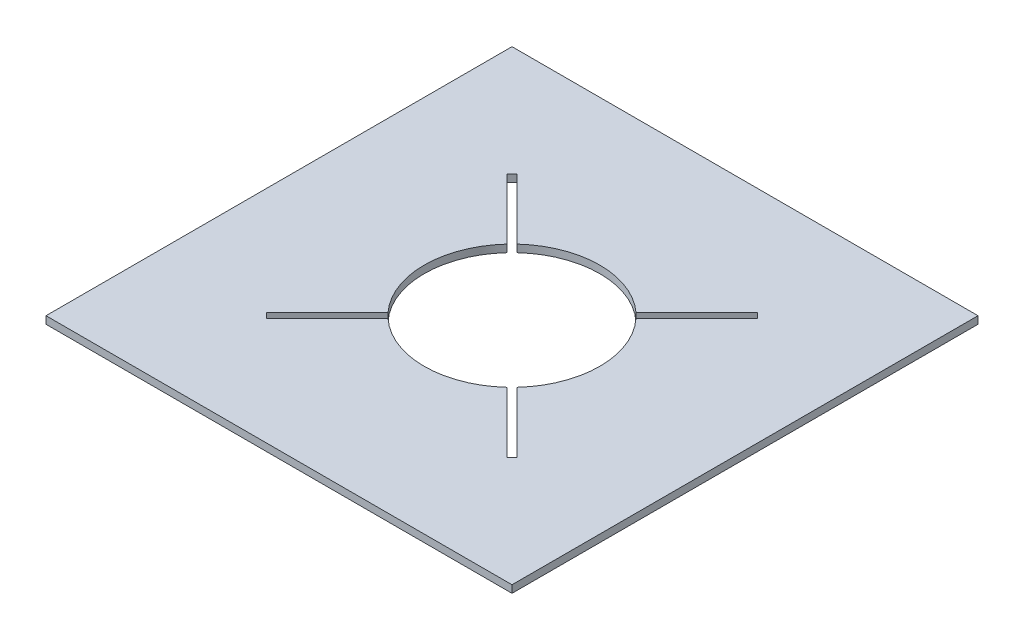
ISO-10303-21;
HEADER;
FILE_DESCRIPTION(('STEP AP214'),'2;1');
FILE_NAME('part.step','',(''),(''),'','','');
FILE_SCHEMA(('AUTOMOTIVE_DESIGN { 1 0 10303 214 1 1 1 1 }'));
ENDSEC;
DATA;
#1=APPLICATION_CONTEXT('core data for automotive mechanical design processes');
#2=APPLICATION_PROTOCOL_DEFINITION('international standard','automotive_design',2000,#1);
#3=PRODUCT_CONTEXT('',#1,'mechanical');
#4=PRODUCT('Part','Part','',(#3));
#5=PRODUCT_RELATED_PRODUCT_CATEGORY('part','',(#4));
#6=PRODUCT_DEFINITION_FORMATION('','',#4);
#7=PRODUCT_DEFINITION_CONTEXT('part definition',#1,'design');
#8=PRODUCT_DEFINITION('design','',#6,#7);
#9=PRODUCT_DEFINITION_SHAPE('','',#8);
#10=(LENGTH_UNIT() NAMED_UNIT(*) SI_UNIT(.MILLI.,.METRE.));
#11=(NAMED_UNIT(*) PLANE_ANGLE_UNIT() SI_UNIT($,.RADIAN.));
#12=(NAMED_UNIT(*) SI_UNIT($,.STERADIAN.) SOLID_ANGLE_UNIT());
#13=UNCERTAINTY_MEASURE_WITH_UNIT(LENGTH_MEASURE(1.E-05),#10,'distance_accuracy_value','');
#14=(GEOMETRIC_REPRESENTATION_CONTEXT(3) GLOBAL_UNCERTAINTY_ASSIGNED_CONTEXT((#13)) GLOBAL_UNIT_ASSIGNED_CONTEXT((#10,
#11,#12)) REPRESENTATION_CONTEXT('',''));
#15=CARTESIAN_POINT('',(0.,0.,0.));
#16=DIRECTION('',(0.,0.,1.));
#17=DIRECTION('',(1.,0.,0.));
#18=AXIS2_PLACEMENT_3D('',#15,#16,#17);
#19=CARTESIAN_POINT('',(0.,0.,0.));
#20=DIRECTION('',(0.,1.,0.));
#21=DIRECTION('',(0.,0.,1.));
#22=AXIS2_PLACEMENT_3D('',#19,#20,#21);
#23=CYLINDRICAL_SURFACE('',#22,77.79258);
#24=CARTESIAN_POINT('',(0.,0.,0.));
#25=DIRECTION('',(0.,1.,0.));
#26=DIRECTION('',(0.,0.,1.));
#27=AXIS2_PLACEMENT_3D('',#24,#25,#26);
#28=CIRCLE('',#27,77.79258);
#29=CARTESIAN_POINT('',(-57.2671491611775,0.,-52.6512975149506));
#30=VERTEX_POINT('',#29);
#31=CARTESIAN_POINT('',(-57.2585452817652,0.,52.6606541477833));
#32=VERTEX_POINT('',#31);
#33=EDGE_CURVE('E259',#30,#32,#28,.T.);
#34=ORIENTED_EDGE('',*,*,#33,.F.);
#35=DIRECTION('',(0.,1.,0.));
#36=VECTOR('',#35,1.);
#37=CARTESIAN_POINT('',(-57.2671491611775,0.,-52.6512975149506));
#38=LINE('',#37,#36);
#39=CARTESIAN_POINT('',(-57.2671491611775,6.60400000000002,-52.6512975149506));
#40=VERTEX_POINT('',#39);
#41=EDGE_CURVE('E217',#30,#40,#38,.T.);
#42=ORIENTED_EDGE('',*,*,#41,.T.);
#43=CARTESIAN_POINT('',(0.,6.60400000000002,0.));
#44=DIRECTION('',(0.,1.,0.));
#45=DIRECTION('',(0.,0.,1.));
#46=AXIS2_PLACEMENT_3D('',#43,#44,#45);
#47=CIRCLE('',#46,77.79258);
#48=CARTESIAN_POINT('',(-57.2585452817652,6.60400000000002,52.6606541477833));
#49=VERTEX_POINT('',#48);
#50=EDGE_CURVE('E265',#40,#49,#47,.T.);
#51=ORIENTED_EDGE('',*,*,#50,.T.);
#52=DIRECTION('',(0.,1.,0.));
#53=VECTOR('',#52,1.);
#54=CARTESIAN_POINT('',(-57.2585452817652,0.,52.6606541477833));
#55=LINE('',#54,#53);
#56=EDGE_CURVE('E306',#49,#32,#55,.F.);
#57=ORIENTED_EDGE('',*,*,#56,.T.);
#58=EDGE_LOOP('',(#34,#42,#51,#57));
#59=FACE_BOUND('',#58,.T.);
#60=ADVANCED_FACE('F33',(#59),#23,.F.);
#61=CARTESIAN_POINT('',(-52.660654147783,6.60400000000002,57.2585452817654));
#62=VERTEX_POINT('',#61);
#63=CARTESIAN_POINT('',(52.6512975149512,6.60400000000002,57.267149161177));
#64=VERTEX_POINT('',#63);
#65=EDGE_CURVE('E262',#62,#64,#47,.T.);
#66=ORIENTED_EDGE('',*,*,#65,.T.);
#67=DIRECTION('',(0.,1.,0.));
#68=VECTOR('',#67,1.);
#69=CARTESIAN_POINT('',(52.6512975149512,0.,57.267149161177));
#70=LINE('',#69,#68);
#71=CARTESIAN_POINT('',(52.6512975149512,0.,57.267149161177));
#72=VERTEX_POINT('',#71);
#73=EDGE_CURVE('E11',#64,#72,#70,.F.);
#74=ORIENTED_EDGE('',*,*,#73,.T.);
#75=CARTESIAN_POINT('',(-52.660654147783,0.,57.2585452817654));
#76=VERTEX_POINT('',#75);
#77=EDGE_CURVE('E257',#76,#72,#28,.T.);
#78=ORIENTED_EDGE('',*,*,#77,.F.);
#79=DIRECTION('',(0.,1.,0.));
#80=VECTOR('',#79,1.);
#81=CARTESIAN_POINT('',(-52.6606541477831,0.,57.2585452817654));
#82=LINE('',#81,#80);
#83=EDGE_CURVE('E291',#76,#62,#82,.T.);
#84=ORIENTED_EDGE('',*,*,#83,.T.);
#85=EDGE_LOOP('',(#66,#74,#78,#84));
#86=FACE_BOUND('',#85,.T.);
#87=ADVANCED_FACE('F371',(#86),#23,.F.);
#88=CARTESIAN_POINT('',(52.660654147783,6.60400000000002,-57.2585452817654));
#89=VERTEX_POINT('',#88);
#90=CARTESIAN_POINT('',(-52.6512975149512,6.60400000000002,-57.2671491611769));
#91=VERTEX_POINT('',#90);
#92=EDGE_CURVE('E266',#89,#91,#47,.T.);
#93=ORIENTED_EDGE('',*,*,#92,.T.);
#94=DIRECTION('',(0.,1.,0.));
#95=VECTOR('',#94,1.);
#96=CARTESIAN_POINT('',(-52.6512975149512,0.,-57.267149161177));
#97=LINE('',#96,#95);
#98=CARTESIAN_POINT('',(-52.6512975149512,0.,-57.2671491611769));
#99=VERTEX_POINT('',#98);
#100=EDGE_CURVE('E211',#91,#99,#97,.F.);
#101=ORIENTED_EDGE('',*,*,#100,.T.);
#102=CARTESIAN_POINT('',(52.660654147783,0.,-57.2585452817654));
#103=VERTEX_POINT('',#102);
#104=EDGE_CURVE('E261',#103,#99,#28,.T.);
#105=ORIENTED_EDGE('',*,*,#104,.F.);
#106=DIRECTION('',(0.,1.,0.));
#107=VECTOR('',#106,1.);
#108=CARTESIAN_POINT('',(52.660654147783,0.,-57.2585452817654));
#109=LINE('',#108,#107);
#110=EDGE_CURVE('E303',#103,#89,#109,.T.);
#111=ORIENTED_EDGE('',*,*,#110,.T.);
#112=EDGE_LOOP('',(#93,#101,#105,#111));
#113=FACE_BOUND('',#112,.T.);
#114=ADVANCED_FACE('F348',(#113),#23,.F.);
#115=CARTESIAN_POINT('',(-206.545890784591,6.60400000000002,206.54589078459));
#116=DIRECTION('',(-1.,0.,0.));
#117=DIRECTION('',(0.,0.,1.));
#118=AXIS2_PLACEMENT_3D('',#115,#116,#117);
#119=PLANE('',#118);
#120=DIRECTION('',(0.,0.,-1.));
#121=VECTOR('',#120,1.);
#122=CARTESIAN_POINT('',(-206.545890784591,0.,206.54589078459));
#123=LINE('',#122,#121);
#124=CARTESIAN_POINT('',(-206.545890784591,0.,206.54589078459));
#125=VERTEX_POINT('',#124);
#126=CARTESIAN_POINT('',(-206.545890784591,0.,-206.54589078459));
#127=VERTEX_POINT('',#126);
#128=EDGE_CURVE('E279',#125,#127,#123,.T.);
#129=ORIENTED_EDGE('',*,*,#128,.F.);
#130=DIRECTION('',(0.,-1.,0.));
#131=VECTOR('',#130,1.);
#132=CARTESIAN_POINT('',(-206.545890784591,6.60400000000002,206.54589078459));
#133=LINE('',#132,#131);
#134=CARTESIAN_POINT('',(-206.545890784591,6.60400000000002,206.54589078459));
#135=VERTEX_POINT('',#134);
#136=EDGE_CURVE('E289',#135,#125,#133,.T.);
#137=ORIENTED_EDGE('',*,*,#136,.F.);
#138=DIRECTION('',(0.,0.,-1.));
#139=VECTOR('',#138,1.);
#140=CARTESIAN_POINT('',(-206.545890784591,6.60400000000002,206.54589078459));
#141=LINE('',#140,#139);
#142=CARTESIAN_POINT('',(-206.545890784591,6.60400000000002,-206.54589078459));
#143=VERTEX_POINT('',#142);
#144=EDGE_CURVE('E267',#135,#143,#141,.T.);
#145=ORIENTED_EDGE('',*,*,#144,.T.);
#146=DIRECTION('',(0.,-1.,0.));
#147=VECTOR('',#146,1.);
#148=CARTESIAN_POINT('',(-206.545890784591,6.60400000000002,-206.54589078459));
#149=LINE('',#148,#147);
#150=EDGE_CURVE('E278',#143,#127,#149,.T.);
#151=ORIENTED_EDGE('',*,*,#150,.T.);
#152=EDGE_LOOP('',(#129,#137,#145,#151));
#153=FACE_BOUND('',#152,.T.);
#154=ADVANCED_FACE('F35',(#153),#119,.T.);
#155=CARTESIAN_POINT('',(-206.545890784591,6.60400000000002,206.54589078459));
#156=DIRECTION('',(0.,0.,-1.));
#157=DIRECTION('',(-1.,0.,0.));
#158=AXIS2_PLACEMENT_3D('',#155,#156,#157);
#159=PLANE('',#158);
#160=DIRECTION('',(1.,0.,0.));
#161=VECTOR('',#160,1.);
#162=CARTESIAN_POINT('',(-206.545890784591,0.,206.54589078459));
#163=LINE('',#162,#161);
#164=CARTESIAN_POINT('',(206.54589078459,0.,206.54589078459));
#165=VERTEX_POINT('',#164);
#166=EDGE_CURVE('E271',#125,#165,#163,.T.);
#167=ORIENTED_EDGE('',*,*,#166,.T.);
#168=DIRECTION('',(0.,-1.,0.));
#169=VECTOR('',#168,1.);
#170=CARTESIAN_POINT('',(206.54589078459,6.60400000000002,206.54589078459));
#171=LINE('',#170,#169);
#172=CARTESIAN_POINT('',(206.54589078459,6.60400000000002,206.54589078459));
#173=VERTEX_POINT('',#172);
#174=EDGE_CURVE('E292',#173,#165,#171,.T.);
#175=ORIENTED_EDGE('',*,*,#174,.F.);
#176=DIRECTION('',(1.,0.,0.));
#177=VECTOR('',#176,1.);
#178=CARTESIAN_POINT('',(-206.545890784591,6.60400000000002,206.54589078459));
#179=LINE('',#178,#177);
#180=EDGE_CURVE('E276',#135,#173,#179,.T.);
#181=ORIENTED_EDGE('',*,*,#180,.F.);
#182=ORIENTED_EDGE('',*,*,#136,.T.);
#183=EDGE_LOOP('',(#167,#175,#181,#182));
#184=FACE_BOUND('',#183,.T.);
#185=ADVANCED_FACE('F392',(#184),#159,.F.);
#186=CARTESIAN_POINT('',(206.54589078459,6.60400000000002,206.54589078459));
#187=DIRECTION('',(-1.,0.,0.));
#188=DIRECTION('',(0.,0.,1.));
#189=AXIS2_PLACEMENT_3D('',#186,#187,#188);
#190=PLANE('',#189);
#191=DIRECTION('',(0.,0.,-1.));
#192=VECTOR('',#191,1.);
#193=CARTESIAN_POINT('',(206.54589078459,0.,206.54589078459));
#194=LINE('',#193,#192);
#195=CARTESIAN_POINT('',(206.54589078459,0.,-206.54589078459));
#196=VERTEX_POINT('',#195);
#197=EDGE_CURVE('E285',#165,#196,#194,.T.);
#198=ORIENTED_EDGE('',*,*,#197,.T.);
#199=DIRECTION('',(0.,-1.,0.));
#200=VECTOR('',#199,1.);
#201=CARTESIAN_POINT('',(206.54589078459,6.60400000000002,-206.54589078459));
#202=LINE('',#201,#200);
#203=CARTESIAN_POINT('',(206.54589078459,6.60400000000002,-206.54589078459));
#204=VERTEX_POINT('',#203);
#205=EDGE_CURVE('E295',#204,#196,#202,.T.);
#206=ORIENTED_EDGE('',*,*,#205,.F.);
#207=DIRECTION('',(0.,0.,-1.));
#208=VECTOR('',#207,1.);
#209=CARTESIAN_POINT('',(206.54589078459,6.60400000000002,206.54589078459));
#210=LINE('',#209,#208);
#211=EDGE_CURVE('E274',#173,#204,#210,.T.);
#212=ORIENTED_EDGE('',*,*,#211,.F.);
#213=ORIENTED_EDGE('',*,*,#174,.T.);
#214=EDGE_LOOP('',(#198,#206,#212,#213));
#215=FACE_BOUND('',#214,.T.);
#216=ADVANCED_FACE('F397',(#215),#190,.F.);
#217=CARTESIAN_POINT('',(-206.545890784591,6.60400000000002,-206.54589078459));
#218=DIRECTION('',(0.,0.,-1.));
#219=DIRECTION('',(-1.,0.,0.));
#220=AXIS2_PLACEMENT_3D('',#217,#218,#219);
#221=PLANE('',#220);
#222=DIRECTION('',(1.,0.,0.));
#223=VECTOR('',#222,1.);
#224=CARTESIAN_POINT('',(-206.545890784591,0.,-206.54589078459));
#225=LINE('',#224,#223);
#226=EDGE_CURVE('E282',#127,#196,#225,.T.);
#227=ORIENTED_EDGE('',*,*,#226,.F.);
#228=ORIENTED_EDGE('',*,*,#150,.F.);
#229=DIRECTION('',(1.,0.,0.));
#230=VECTOR('',#229,1.);
#231=CARTESIAN_POINT('',(-206.545890784591,6.60400000000002,-206.54589078459));
#232=LINE('',#231,#230);
#233=EDGE_CURVE('E270',#143,#204,#232,.T.);
#234=ORIENTED_EDGE('',*,*,#233,.T.);
#235=ORIENTED_EDGE('',*,*,#205,.T.);
#236=EDGE_LOOP('',(#227,#228,#234,#235));
#237=FACE_BOUND('',#236,.T.);
#238=ADVANCED_FACE('F412',(#237),#221,.T.);
#239=CARTESIAN_POINT('',(0.,6.60400000000002,0.));
#240=DIRECTION('',(0.,-1.,0.));
#241=DIRECTION('',(0.,0.,-1.));
#242=AXIS2_PLACEMENT_3D('',#239,#240,#241);
#243=PLANE('',#242);
#244=ORIENTED_EDGE('',*,*,#50,.F.);
#245=DIRECTION('',(0.707106781186551,0.,0.707106781186544));
#246=VECTOR('',#245,1.);
#247=CARTESIAN_POINT('',(106.586659900972,6.60400000000002,111.202511547197));
#248=LINE('',#247,#246);
#249=CARTESIAN_POINT('',(-111.202511547199,6.60400000000002,-106.586659900971));
#250=VERTEX_POINT('',#249);
#251=EDGE_CURVE('E195',#250,#40,#248,.T.);
#252=ORIENTED_EDGE('',*,*,#251,.F.);
#253=DIRECTION('',(-0.707106781186543,0.,0.707106781186552));
#254=VECTOR('',#253,1.);
#255=CARTESIAN_POINT('',(-106.586659900972,6.60400000000002,-111.202511547197));
#256=LINE('',#255,#254);
#257=CARTESIAN_POINT('',(-106.586659900972,6.60400000000002,-111.202511547197));
#258=VERTEX_POINT('',#257);
#259=EDGE_CURVE('E206',#258,#250,#256,.T.);
#260=ORIENTED_EDGE('',*,*,#259,.F.);
#261=DIRECTION('',(-0.707106781186551,0.,-0.707106781186544));
#262=VECTOR('',#261,1.);
#263=CARTESIAN_POINT('',(111.202511547198,6.60400000000002,106.586659900971));
#264=LINE('',#263,#262);
#265=EDGE_CURVE('E204',#91,#258,#264,.T.);
#266=ORIENTED_EDGE('',*,*,#265,.F.);
#267=ORIENTED_EDGE('',*,*,#92,.F.);
#268=DIRECTION('',(-0.707106781186546,0.,0.707106781186549));
#269=VECTOR('',#268,1.);
#270=CARTESIAN_POINT('',(-111.193531291075,6.60400000000002,106.595640157093));
#271=LINE('',#270,#269);
#272=CARTESIAN_POINT('',(106.595640157094,6.60400000000002,-111.193531291076));
#273=VERTEX_POINT('',#272);
#274=EDGE_CURVE('E225',#273,#89,#271,.T.);
#275=ORIENTED_EDGE('',*,*,#274,.F.);
#276=DIRECTION('',(-0.707106781186549,0.,-0.707106781186546));
#277=VECTOR('',#276,1.);
#278=CARTESIAN_POINT('',(106.595640157094,6.60400000000002,-111.193531291076));
#279=LINE('',#278,#277);
#280=CARTESIAN_POINT('',(111.193531291076,6.60400000000002,-106.595640157094));
#281=VERTEX_POINT('',#280);
#282=EDGE_CURVE('E242',#281,#273,#279,.T.);
#283=ORIENTED_EDGE('',*,*,#282,.F.);
#284=DIRECTION('',(0.707106781186546,0.,-0.707106781186549));
#285=VECTOR('',#284,1.);
#286=CARTESIAN_POINT('',(-106.595640157093,6.60400000000002,111.193531291075));
#287=LINE('',#286,#285);
#288=CARTESIAN_POINT('',(57.2585452817652,6.60400000000002,-52.6606541477833));
#289=VERTEX_POINT('',#288);
#290=EDGE_CURVE('E239',#289,#281,#287,.T.);
#291=ORIENTED_EDGE('',*,*,#290,.F.);
#292=CARTESIAN_POINT('',(57.2671491611775,6.60400000000002,52.6512975149506));
#293=VERTEX_POINT('',#292);
#294=EDGE_CURVE('E250',#293,#289,#47,.T.);
#295=ORIENTED_EDGE('',*,*,#294,.F.);
#296=CARTESIAN_POINT('',(111.202511547198,6.60400000000002,106.586659900971));
#297=VERTEX_POINT('',#296);
#298=EDGE_CURVE('E56',#297,#293,#264,.T.);
#299=ORIENTED_EDGE('',*,*,#298,.F.);
#300=DIRECTION('',(0.707106781186543,0.,-0.707106781186552));
#301=VECTOR('',#300,1.);
#302=CARTESIAN_POINT('',(111.202511547198,6.60400000000002,106.586659900971));
#303=LINE('',#302,#301);
#304=CARTESIAN_POINT('',(106.586659900972,6.60400000000002,111.202511547197));
#305=VERTEX_POINT('',#304);
#306=EDGE_CURVE('E179',#305,#297,#303,.T.);
#307=ORIENTED_EDGE('',*,*,#306,.F.);
#308=EDGE_CURVE('E198',#64,#305,#248,.T.);
#309=ORIENTED_EDGE('',*,*,#308,.F.);
#310=ORIENTED_EDGE('',*,*,#65,.F.);
#311=CARTESIAN_POINT('',(-106.595640157093,6.60400000000002,111.193531291075));
#312=VERTEX_POINT('',#311);
#313=EDGE_CURVE('E240',#312,#62,#287,.T.);
#314=ORIENTED_EDGE('',*,*,#313,.F.);
#315=DIRECTION('',(0.70710678118655,0.,0.707106781186545));
#316=VECTOR('',#315,1.);
#317=CARTESIAN_POINT('',(-111.193531291075,6.60400000000002,106.595640157093));
#318=LINE('',#317,#316);
#319=CARTESIAN_POINT('',(-111.193531291075,6.60400000000002,106.595640157093));
#320=VERTEX_POINT('',#319);
#321=EDGE_CURVE('E220',#320,#312,#318,.T.);
#322=ORIENTED_EDGE('',*,*,#321,.F.);
#323=EDGE_CURVE('E245',#49,#320,#271,.T.);
#324=ORIENTED_EDGE('',*,*,#323,.F.);
#325=EDGE_LOOP('',(#244,#252,#260,#266,#267,#275,#283,#291,#295,#299,#307,#309,#310,#314,#322,#324));
#326=FACE_BOUND('',#325,.T.);
#327=ORIENTED_EDGE('',*,*,#144,.F.);
#328=ORIENTED_EDGE('',*,*,#180,.T.);
#329=ORIENTED_EDGE('',*,*,#211,.T.);
#330=ORIENTED_EDGE('',*,*,#233,.F.);
#331=EDGE_LOOP('',(#327,#328,#329,#330));
#332=FACE_BOUND('',#331,.T.);
#333=ADVANCED_FACE('F315',(#326,#332),#243,.F.);
#334=CARTESIAN_POINT('',(0.,0.,0.));
#335=DIRECTION('',(0.,-1.,0.));
#336=DIRECTION('',(0.,0.,-1.));
#337=AXIS2_PLACEMENT_3D('',#334,#335,#336);
#338=PLANE('',#337);
#339=DIRECTION('',(0.707106781186551,0.,0.707106781186544));
#340=VECTOR('',#339,1.);
#341=CARTESIAN_POINT('',(106.586659900972,0.,111.202511547197));
#342=LINE('',#341,#340);
#343=CARTESIAN_POINT('',(-111.202511547199,0.,-106.586659900971));
#344=VERTEX_POINT('',#343);
#345=EDGE_CURVE('E181',#344,#30,#342,.T.);
#346=ORIENTED_EDGE('',*,*,#345,.T.);
#347=ORIENTED_EDGE('',*,*,#33,.T.);
#348=DIRECTION('',(-0.707106781186546,0.,0.707106781186549));
#349=VECTOR('',#348,1.);
#350=CARTESIAN_POINT('',(-111.193531291075,0.,106.595640157093));
#351=LINE('',#350,#349);
#352=CARTESIAN_POINT('',(-111.193531291075,0.,106.595640157093));
#353=VERTEX_POINT('',#352);
#354=EDGE_CURVE('E232',#32,#353,#351,.T.);
#355=ORIENTED_EDGE('',*,*,#354,.T.);
#356=DIRECTION('',(0.70710678118655,0.,0.707106781186545));
#357=VECTOR('',#356,1.);
#358=CARTESIAN_POINT('',(-111.193531291075,0.,106.595640157093));
#359=LINE('',#358,#357);
#360=CARTESIAN_POINT('',(-106.595640157093,0.,111.193531291075));
#361=VERTEX_POINT('',#360);
#362=EDGE_CURVE('E221',#353,#361,#359,.T.);
#363=ORIENTED_EDGE('',*,*,#362,.T.);
#364=DIRECTION('',(0.707106781186546,0.,-0.707106781186549));
#365=VECTOR('',#364,1.);
#366=CARTESIAN_POINT('',(-106.595640157093,0.,111.193531291075));
#367=LINE('',#366,#365);
#368=EDGE_CURVE('E226',#361,#76,#367,.T.);
#369=ORIENTED_EDGE('',*,*,#368,.T.);
#370=ORIENTED_EDGE('',*,*,#77,.T.);
#371=CARTESIAN_POINT('',(106.586659900972,0.,111.202511547197));
#372=VERTEX_POINT('',#371);
#373=EDGE_CURVE('E194',#72,#372,#342,.T.);
#374=ORIENTED_EDGE('',*,*,#373,.T.);
#375=DIRECTION('',(0.707106781186543,0.,-0.707106781186552));
#376=VECTOR('',#375,1.);
#377=CARTESIAN_POINT('',(111.202511547198,0.,106.586659900971));
#378=LINE('',#377,#376);
#379=CARTESIAN_POINT('',(111.202511547198,0.,106.586659900971));
#380=VERTEX_POINT('',#379);
#381=EDGE_CURVE('E176',#372,#380,#378,.T.);
#382=ORIENTED_EDGE('',*,*,#381,.T.);
#383=DIRECTION('',(-0.707106781186551,0.,-0.707106781186544));
#384=VECTOR('',#383,1.);
#385=CARTESIAN_POINT('',(111.202511547198,0.,106.586659900971));
#386=LINE('',#385,#384);
#387=CARTESIAN_POINT('',(57.2671491611775,0.,52.6512975149506));
#388=VERTEX_POINT('',#387);
#389=EDGE_CURVE('E184',#380,#388,#386,.T.);
#390=ORIENTED_EDGE('',*,*,#389,.T.);
#391=CARTESIAN_POINT('',(57.2585452817652,0.,-52.6606541477833));
#392=VERTEX_POINT('',#391);
#393=EDGE_CURVE('E260',#388,#392,#28,.T.);
#394=ORIENTED_EDGE('',*,*,#393,.T.);
#395=CARTESIAN_POINT('',(111.193531291076,0.,-106.595640157094));
#396=VERTEX_POINT('',#395);
#397=EDGE_CURVE('E224',#392,#396,#367,.T.);
#398=ORIENTED_EDGE('',*,*,#397,.T.);
#399=DIRECTION('',(-0.707106781186549,0.,-0.707106781186546));
#400=VECTOR('',#399,1.);
#401=CARTESIAN_POINT('',(106.595640157094,0.,-111.193531291076));
#402=LINE('',#401,#400);
#403=CARTESIAN_POINT('',(106.595640157094,0.,-111.193531291076));
#404=VERTEX_POINT('',#403);
#405=EDGE_CURVE('E229',#396,#404,#402,.T.);
#406=ORIENTED_EDGE('',*,*,#405,.T.);
#407=EDGE_CURVE('E233',#404,#103,#351,.T.);
#408=ORIENTED_EDGE('',*,*,#407,.T.);
#409=ORIENTED_EDGE('',*,*,#104,.T.);
#410=CARTESIAN_POINT('',(-106.586659900972,0.,-111.202511547197));
#411=VERTEX_POINT('',#410);
#412=EDGE_CURVE('E188',#99,#411,#386,.T.);
#413=ORIENTED_EDGE('',*,*,#412,.T.);
#414=DIRECTION('',(-0.707106781186543,0.,0.707106781186552));
#415=VECTOR('',#414,1.);
#416=CARTESIAN_POINT('',(-106.586659900972,0.,-111.202511547197));
#417=LINE('',#416,#415);
#418=EDGE_CURVE('E48',#411,#344,#417,.T.);
#419=ORIENTED_EDGE('',*,*,#418,.T.);
#420=EDGE_LOOP('',(#346,#347,#355,#363,#369,#370,#374,#382,#390,#394,#398,#406,#408,#409,#413,#419));
#421=FACE_BOUND('',#420,.T.);
#422=ORIENTED_EDGE('',*,*,#128,.T.);
#423=ORIENTED_EDGE('',*,*,#226,.T.);
#424=ORIENTED_EDGE('',*,*,#197,.F.);
#425=ORIENTED_EDGE('',*,*,#166,.F.);
#426=EDGE_LOOP('',(#422,#423,#424,#425));
#427=FACE_BOUND('',#426,.T.);
#428=ADVANCED_FACE('F191',(#421,#427),#338,.T.);
#429=ORIENTED_EDGE('',*,*,#393,.F.);
#430=DIRECTION('',(0.,1.,0.));
#431=VECTOR('',#430,1.);
#432=CARTESIAN_POINT('',(57.2671491611775,0.,52.6512975149506));
#433=LINE('',#432,#431);
#434=EDGE_CURVE('E41',#388,#293,#433,.T.);
#435=ORIENTED_EDGE('',*,*,#434,.T.);
#436=ORIENTED_EDGE('',*,*,#294,.T.);
#437=DIRECTION('',(0.,1.,0.));
#438=VECTOR('',#437,1.);
#439=CARTESIAN_POINT('',(57.2585452817652,0.,-52.6606541477833));
#440=LINE('',#439,#438);
#441=EDGE_CURVE('E300',#289,#392,#440,.F.);
#442=ORIENTED_EDGE('',*,*,#441,.T.);
#443=EDGE_LOOP('',(#429,#435,#436,#442));
#444=FACE_BOUND('',#443,.T.);
#445=ADVANCED_FACE('F310',(#444),#23,.F.);
#446=CARTESIAN_POINT('',(-106.595640157093,0.,111.193531291075));
#447=DIRECTION('',(0.707106781186549,0.,0.707106781186546));
#448=DIRECTION('',(0.707106781186546,0.,-0.707106781186549));
#449=AXIS2_PLACEMENT_3D('',#446,#447,#448);
#450=PLANE('',#449);
#451=ORIENTED_EDGE('',*,*,#368,.F.);
#452=DIRECTION('',(0.,1.,0.));
#453=VECTOR('',#452,1.);
#454=CARTESIAN_POINT('',(-106.595640157093,0.,111.193531291075));
#455=LINE('',#454,#453);
#456=EDGE_CURVE('E236',#361,#312,#455,.T.);
#457=ORIENTED_EDGE('',*,*,#456,.T.);
#458=ORIENTED_EDGE('',*,*,#313,.T.);
#459=ORIENTED_EDGE('',*,*,#83,.F.);
#460=EDGE_LOOP('',(#451,#457,#458,#459));
#461=FACE_BOUND('',#460,.T.);
#462=ADVANCED_FACE('F380',(#461),#450,.F.);
#463=CARTESIAN_POINT('',(-111.193531291075,0.,106.595640157093));
#464=DIRECTION('',(-0.707106781186549,0.,-0.707106781186546));
#465=DIRECTION('',(-0.707106781186546,0.,0.707106781186549));
#466=AXIS2_PLACEMENT_3D('',#463,#464,#465);
#467=PLANE('',#466);
#468=ORIENTED_EDGE('',*,*,#323,.T.);
#469=DIRECTION('',(0.,1.,0.));
#470=VECTOR('',#469,1.);
#471=CARTESIAN_POINT('',(-111.193531291075,0.,106.595640157093));
#472=LINE('',#471,#470);
#473=EDGE_CURVE('E247',#353,#320,#472,.T.);
#474=ORIENTED_EDGE('',*,*,#473,.F.);
#475=ORIENTED_EDGE('',*,*,#354,.F.);
#476=ORIENTED_EDGE('',*,*,#56,.F.);
#477=EDGE_LOOP('',(#468,#474,#475,#476));
#478=FACE_BOUND('',#477,.T.);
#479=ADVANCED_FACE('F326',(#478),#467,.F.);
#480=CARTESIAN_POINT('',(-111.193531291075,0.,106.595640157093));
#481=DIRECTION('',(-0.707106781186545,0.,0.70710678118655));
#482=DIRECTION('',(0.70710678118655,0.,0.707106781186545));
#483=AXIS2_PLACEMENT_3D('',#480,#481,#482);
#484=PLANE('',#483);
#485=ORIENTED_EDGE('',*,*,#321,.T.);
#486=ORIENTED_EDGE('',*,*,#456,.F.);
#487=ORIENTED_EDGE('',*,*,#362,.F.);
#488=ORIENTED_EDGE('',*,*,#473,.T.);
#489=EDGE_LOOP('',(#485,#486,#487,#488));
#490=FACE_BOUND('',#489,.T.);
#491=ADVANCED_FACE('F332',(#490),#484,.F.);
#492=ORIENTED_EDGE('',*,*,#407,.F.);
#493=DIRECTION('',(0.,1.,0.));
#494=VECTOR('',#493,1.);
#495=CARTESIAN_POINT('',(106.595640157094,0.,-111.193531291076));
#496=LINE('',#495,#494);
#497=EDGE_CURVE('E251',#404,#273,#496,.T.);
#498=ORIENTED_EDGE('',*,*,#497,.T.);
#499=ORIENTED_EDGE('',*,*,#274,.T.);
#500=ORIENTED_EDGE('',*,*,#110,.F.);
#501=EDGE_LOOP('',(#492,#498,#499,#500));
#502=FACE_BOUND('',#501,.T.);
#503=ADVANCED_FACE('F471',(#502),#467,.F.);
#504=ORIENTED_EDGE('',*,*,#290,.T.);
#505=DIRECTION('',(0.,1.,0.));
#506=VECTOR('',#505,1.);
#507=CARTESIAN_POINT('',(111.193531291076,0.,-106.595640157094));
#508=LINE('',#507,#506);
#509=EDGE_CURVE('E253',#396,#281,#508,.T.);
#510=ORIENTED_EDGE('',*,*,#509,.F.);
#511=ORIENTED_EDGE('',*,*,#397,.F.);
#512=ORIENTED_EDGE('',*,*,#441,.F.);
#513=EDGE_LOOP('',(#504,#510,#511,#512));
#514=FACE_BOUND('',#513,.T.);
#515=ADVANCED_FACE('F340',(#514),#450,.F.);
#516=CARTESIAN_POINT('',(106.595640157094,0.,-111.193531291076));
#517=DIRECTION('',(0.707106781186546,0.,-0.707106781186549));
#518=DIRECTION('',(-0.707106781186549,0.,-0.707106781186546));
#519=AXIS2_PLACEMENT_3D('',#516,#517,#518);
#520=PLANE('',#519);
#521=ORIENTED_EDGE('',*,*,#282,.T.);
#522=ORIENTED_EDGE('',*,*,#497,.F.);
#523=ORIENTED_EDGE('',*,*,#405,.F.);
#524=ORIENTED_EDGE('',*,*,#509,.T.);
#525=EDGE_LOOP('',(#521,#522,#523,#524));
#526=FACE_BOUND('',#525,.T.);
#527=ADVANCED_FACE('F343',(#526),#520,.F.);
#528=CARTESIAN_POINT('',(111.202511547198,0.,106.586659900971));
#529=DIRECTION('',(0.707106781186544,0.,-0.707106781186551));
#530=DIRECTION('',(-0.707106781186551,0.,-0.707106781186544));
#531=AXIS2_PLACEMENT_3D('',#528,#529,#530);
#532=PLANE('',#531);
#533=ORIENTED_EDGE('',*,*,#389,.F.);
#534=DIRECTION('',(0.,1.,0.));
#535=VECTOR('',#534,1.);
#536=CARTESIAN_POINT('',(111.202511547198,0.,106.586659900971));
#537=LINE('',#536,#535);
#538=EDGE_CURVE('E171',#380,#297,#537,.T.);
#539=ORIENTED_EDGE('',*,*,#538,.T.);
#540=ORIENTED_EDGE('',*,*,#298,.T.);
#541=ORIENTED_EDGE('',*,*,#434,.F.);
#542=EDGE_LOOP('',(#533,#539,#540,#541));
#543=FACE_BOUND('',#542,.T.);
#544=ADVANCED_FACE('F185',(#543),#532,.F.);
#545=CARTESIAN_POINT('',(106.586659900972,0.,111.202511547197));
#546=DIRECTION('',(-0.707106781186544,0.,0.707106781186551));
#547=DIRECTION('',(0.707106781186551,0.,0.707106781186544));
#548=AXIS2_PLACEMENT_3D('',#545,#546,#547);
#549=PLANE('',#548);
#550=ORIENTED_EDGE('',*,*,#308,.T.);
#551=DIRECTION('',(0.,1.,0.));
#552=VECTOR('',#551,1.);
#553=CARTESIAN_POINT('',(106.586659900972,0.,111.202511547197));
#554=LINE('',#553,#552);
#555=EDGE_CURVE('E209',#372,#305,#554,.T.);
#556=ORIENTED_EDGE('',*,*,#555,.F.);
#557=ORIENTED_EDGE('',*,*,#373,.F.);
#558=ORIENTED_EDGE('',*,*,#73,.F.);
#559=EDGE_LOOP('',(#550,#556,#557,#558));
#560=FACE_BOUND('',#559,.T.);
#561=ADVANCED_FACE('F360',(#560),#549,.F.);
#562=CARTESIAN_POINT('',(111.202511547198,0.,106.586659900971));
#563=DIRECTION('',(0.707106781186552,0.,0.707106781186543));
#564=DIRECTION('',(0.707106781186543,0.,-0.707106781186552));
#565=AXIS2_PLACEMENT_3D('',#562,#563,#564);
#566=PLANE('',#565);
#567=ORIENTED_EDGE('',*,*,#306,.T.);
#568=ORIENTED_EDGE('',*,*,#538,.F.);
#569=ORIENTED_EDGE('',*,*,#381,.F.);
#570=ORIENTED_EDGE('',*,*,#555,.T.);
#571=EDGE_LOOP('',(#567,#568,#569,#570));
#572=FACE_BOUND('',#571,.T.);
#573=ADVANCED_FACE('F173',(#572),#566,.F.);
#574=ORIENTED_EDGE('',*,*,#345,.F.);
#575=DIRECTION('',(0.,1.,0.));
#576=VECTOR('',#575,1.);
#577=CARTESIAN_POINT('',(-111.202511547199,0.,-106.586659900971));
#578=LINE('',#577,#576);
#579=EDGE_CURVE('E212',#344,#250,#578,.T.);
#580=ORIENTED_EDGE('',*,*,#579,.T.);
#581=ORIENTED_EDGE('',*,*,#251,.T.);
#582=ORIENTED_EDGE('',*,*,#41,.F.);
#583=EDGE_LOOP('',(#574,#580,#581,#582));
#584=FACE_BOUND('',#583,.T.);
#585=ADVANCED_FACE('F357',(#584),#549,.F.);
#586=ORIENTED_EDGE('',*,*,#265,.T.);
#587=DIRECTION('',(0.,1.,0.));
#588=VECTOR('',#587,1.);
#589=CARTESIAN_POINT('',(-106.586659900972,0.,-111.202511547197));
#590=LINE('',#589,#588);
#591=EDGE_CURVE('E180',#411,#258,#590,.T.);
#592=ORIENTED_EDGE('',*,*,#591,.F.);
#593=ORIENTED_EDGE('',*,*,#412,.F.);
#594=ORIENTED_EDGE('',*,*,#100,.F.);
#595=EDGE_LOOP('',(#586,#592,#593,#594));
#596=FACE_BOUND('',#595,.T.);
#597=ADVANCED_FACE('F352',(#596),#532,.F.);
#598=CARTESIAN_POINT('',(-106.586659900972,0.,-111.202511547197));
#599=DIRECTION('',(-0.707106781186552,0.,-0.707106781186543));
#600=DIRECTION('',(-0.707106781186543,0.,0.707106781186552));
#601=AXIS2_PLACEMENT_3D('',#598,#599,#600);
#602=PLANE('',#601);
#603=ORIENTED_EDGE('',*,*,#259,.T.);
#604=ORIENTED_EDGE('',*,*,#579,.F.);
#605=ORIENTED_EDGE('',*,*,#418,.F.);
#606=ORIENTED_EDGE('',*,*,#591,.T.);
#607=EDGE_LOOP('',(#603,#604,#605,#606));
#608=FACE_BOUND('',#607,.T.);
#609=ADVANCED_FACE('F355',(#608),#602,.F.);
#610=CLOSED_SHELL('',(#60,#87,#114,#154,#185,#216,#238,#333,#428,#445,#462,#479,#491,#503,#515,
#527,#544,#561,#573,#585,#597,#609));
#611=MANIFOLD_SOLID_BREP('B2',#610);
#612=ADVANCED_BREP_SHAPE_REPRESENTATION('',(#18,#611),#14);
#613=SHAPE_DEFINITION_REPRESENTATION(#9,#612);
ENDSEC;
END-ISO-10303-21;
